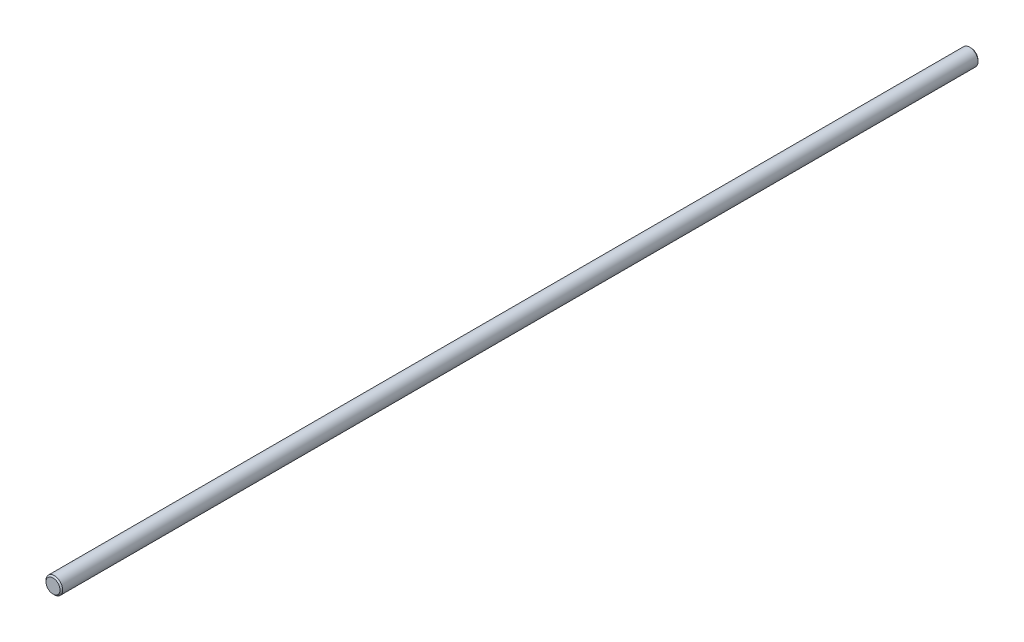
ISO-10303-21;
HEADER;
FILE_DESCRIPTION(('STEP AP214'),'2;1');
FILE_NAME('part.step','',(''),(''),'','','');
FILE_SCHEMA(('AUTOMOTIVE_DESIGN { 1 0 10303 214 1 1 1 1 }'));
ENDSEC;
DATA;
#1=APPLICATION_CONTEXT('core data for automotive mechanical design processes');
#2=APPLICATION_PROTOCOL_DEFINITION('international standard','automotive_design',2000,#1);
#3=PRODUCT_CONTEXT('',#1,'mechanical');
#4=PRODUCT('Part','Part','',(#3));
#5=PRODUCT_RELATED_PRODUCT_CATEGORY('part','',(#4));
#6=PRODUCT_DEFINITION_FORMATION('','',#4);
#7=PRODUCT_DEFINITION_CONTEXT('part definition',#1,'design');
#8=PRODUCT_DEFINITION('design','',#6,#7);
#9=PRODUCT_DEFINITION_SHAPE('','',#8);
#10=(LENGTH_UNIT() NAMED_UNIT(*) SI_UNIT(.MILLI.,.METRE.));
#11=(NAMED_UNIT(*) PLANE_ANGLE_UNIT() SI_UNIT($,.RADIAN.));
#12=(NAMED_UNIT(*) SI_UNIT($,.STERADIAN.) SOLID_ANGLE_UNIT());
#13=UNCERTAINTY_MEASURE_WITH_UNIT(LENGTH_MEASURE(1.E-05),#10,'distance_accuracy_value','');
#14=(GEOMETRIC_REPRESENTATION_CONTEXT(3) GLOBAL_UNCERTAINTY_ASSIGNED_CONTEXT((#13)) GLOBAL_UNIT_ASSIGNED_CONTEXT((#10,
#11,#12)) REPRESENTATION_CONTEXT('',''));
#15=CARTESIAN_POINT('',(0.,0.,0.));
#16=DIRECTION('',(0.,0.,1.));
#17=DIRECTION('',(1.,0.,0.));
#18=AXIS2_PLACEMENT_3D('',#15,#16,#17);
#19=CARTESIAN_POINT('',(0.,0.,349.25));
#20=DIRECTION('',(0.,0.,-1.));
#21=DIRECTION('',(-1.,0.,0.));
#22=AXIS2_PLACEMENT_3D('',#19,#20,#21);
#23=CYLINDRICAL_SURFACE('',#22,3.175);
#24=CARTESIAN_POINT('',(0.,0.,0.508000000000008));
#25=DIRECTION('',(0.,0.,1.));
#26=DIRECTION('',(1.,0.,0.));
#27=AXIS2_PLACEMENT_3D('',#24,#25,#26);
#28=CIRCLE('',#27,3.175);
#29=CARTESIAN_POINT('',(3.175,0.,0.508000000000008));
#30=VERTEX_POINT('',#29);
#31=EDGE_CURVE('E43',#30,#30,#28,.T.);
#32=ORIENTED_EDGE('',*,*,#31,.T.);
#33=EDGE_LOOP('',(#32));
#34=FACE_BOUND('',#33,.T.);
#35=CARTESIAN_POINT('',(0.,0.,348.742));
#36=DIRECTION('',(0.,0.,1.));
#37=DIRECTION('',(1.,0.,0.));
#38=AXIS2_PLACEMENT_3D('',#35,#36,#37);
#39=CIRCLE('',#38,3.175);
#40=CARTESIAN_POINT('',(3.175,0.,348.742));
#41=VERTEX_POINT('',#40);
#42=EDGE_CURVE('E47',#41,#41,#39,.F.);
#43=ORIENTED_EDGE('',*,*,#42,.T.);
#44=EDGE_LOOP('',(#43));
#45=FACE_BOUND('',#44,.T.);
#46=ADVANCED_FACE('F32',(#34,#45),#23,.T.);
#47=CARTESIAN_POINT('',(0.,0.,349.25));
#48=DIRECTION('',(0.,0.,1.));
#49=DIRECTION('',(1.,0.,0.));
#50=AXIS2_PLACEMENT_3D('',#47,#48,#49);
#51=PLANE('',#50);
#52=CARTESIAN_POINT('',(0.,0.,349.25));
#53=DIRECTION('',(0.,0.,1.));
#54=DIRECTION('',(1.,0.,0.));
#55=AXIS2_PLACEMENT_3D('',#52,#53,#54);
#56=CIRCLE('',#55,2.66699999999989);
#57=CARTESIAN_POINT('',(2.66699999999989,0.,349.25));
#58=VERTEX_POINT('',#57);
#59=EDGE_CURVE('E10',#58,#58,#56,.T.);
#60=ORIENTED_EDGE('',*,*,#59,.T.);
#61=EDGE_LOOP('',(#60));
#62=FACE_BOUND('',#61,.T.);
#63=ADVANCED_FACE('F63',(#62),#51,.T.);
#64=CARTESIAN_POINT('',(0.,0.,0.));
#65=DIRECTION('',(0.,0.,1.));
#66=DIRECTION('',(1.,0.,0.));
#67=AXIS2_PLACEMENT_3D('',#64,#65,#66);
#68=PLANE('',#67);
#69=CARTESIAN_POINT('',(0.,0.,0.));
#70=DIRECTION('',(0.,0.,1.));
#71=DIRECTION('',(1.,0.,0.));
#72=AXIS2_PLACEMENT_3D('',#69,#70,#71);
#73=CIRCLE('',#72,2.667);
#74=CARTESIAN_POINT('',(2.667,0.,0.));
#75=VERTEX_POINT('',#74);
#76=EDGE_CURVE('E39',#75,#75,#73,.F.);
#77=ORIENTED_EDGE('',*,*,#76,.T.);
#78=EDGE_LOOP('',(#77));
#79=FACE_BOUND('',#78,.T.);
#80=ADVANCED_FACE('F60',(#79),#68,.F.);
#81=CARTESIAN_POINT('',(0.,0.,0.508000000000008));
#82=DIRECTION('',(0.,0.,1.));
#83=DIRECTION('',(1.,0.,0.));
#84=AXIS2_PLACEMENT_3D('',#81,#82,#83);
#85=CONICAL_SURFACE('',#84,3.175,0.785398163397437);
#86=ORIENTED_EDGE('',*,*,#76,.F.);
#87=EDGE_LOOP('',(#86));
#88=FACE_BOUND('',#87,.T.);
#89=ORIENTED_EDGE('',*,*,#31,.F.);
#90=EDGE_LOOP('',(#89));
#91=FACE_BOUND('',#90,.T.);
#92=ADVANCED_FACE('F56',(#88,#91),#85,.T.);
#93=CARTESIAN_POINT('',(0.,0.,349.25));
#94=DIRECTION('',(0.,0.,-1.));
#95=DIRECTION('',(-1.,0.,0.));
#96=AXIS2_PLACEMENT_3D('',#93,#94,#95);
#97=CONICAL_SURFACE('',#96,2.66699999999989,0.785398163397437);
#98=ORIENTED_EDGE('',*,*,#42,.F.);
#99=EDGE_LOOP('',(#98));
#100=FACE_BOUND('',#99,.T.);
#101=ORIENTED_EDGE('',*,*,#59,.F.);
#102=EDGE_LOOP('',(#101));
#103=FACE_BOUND('',#102,.T.);
#104=ADVANCED_FACE('F34',(#100,#103),#97,.T.);
#105=CLOSED_SHELL('',(#46,#63,#80,#92,#104));
#106=MANIFOLD_SOLID_BREP('B2',#105);
#107=ADVANCED_BREP_SHAPE_REPRESENTATION('',(#18,#106),#14);
#108=SHAPE_DEFINITION_REPRESENTATION(#9,#107);
ENDSEC;
END-ISO-10303-21;
